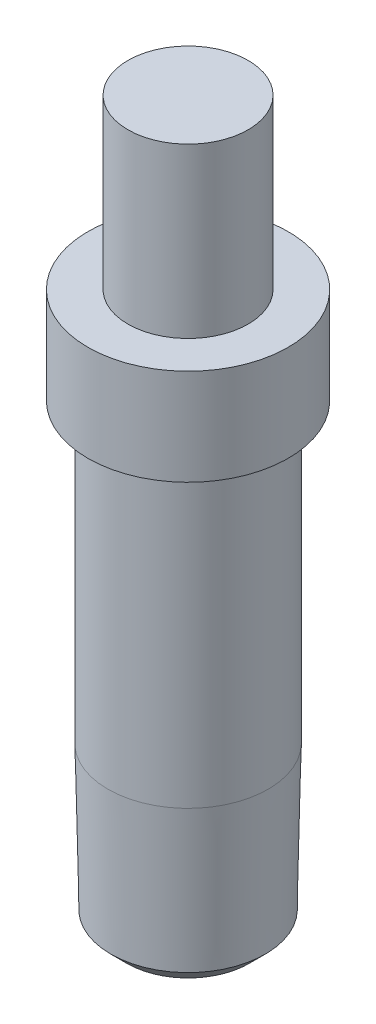
ISO-10303-21;
HEADER;
FILE_DESCRIPTION(('STEP AP214'),'2;1');
FILE_NAME('part.step','',(''),(''),'','','');
FILE_SCHEMA(('AUTOMOTIVE_DESIGN { 1 0 10303 214 1 1 1 1 }'));
ENDSEC;
DATA;
#1=APPLICATION_CONTEXT('core data for automotive mechanical design processes');
#2=APPLICATION_PROTOCOL_DEFINITION('international standard','automotive_design',2000,#1);
#3=PRODUCT_CONTEXT('',#1,'mechanical');
#4=PRODUCT('Part','Part','',(#3));
#5=PRODUCT_RELATED_PRODUCT_CATEGORY('part','',(#4));
#6=PRODUCT_DEFINITION_FORMATION('','',#4);
#7=PRODUCT_DEFINITION_CONTEXT('part definition',#1,'design');
#8=PRODUCT_DEFINITION('design','',#6,#7);
#9=PRODUCT_DEFINITION_SHAPE('','',#8);
#10=(LENGTH_UNIT() NAMED_UNIT(*) SI_UNIT(.MILLI.,.METRE.));
#11=(NAMED_UNIT(*) PLANE_ANGLE_UNIT() SI_UNIT($,.RADIAN.));
#12=(NAMED_UNIT(*) SI_UNIT($,.STERADIAN.) SOLID_ANGLE_UNIT());
#13=UNCERTAINTY_MEASURE_WITH_UNIT(LENGTH_MEASURE(1.E-05),#10,'distance_accuracy_value','');
#14=(GEOMETRIC_REPRESENTATION_CONTEXT(3) GLOBAL_UNCERTAINTY_ASSIGNED_CONTEXT((#13)) GLOBAL_UNIT_ASSIGNED_CONTEXT((#10,
#11,#12)) REPRESENTATION_CONTEXT('',''));
#15=CARTESIAN_POINT('',(0.,0.,0.));
#16=DIRECTION('',(0.,0.,1.));
#17=DIRECTION('',(1.,0.,0.));
#18=AXIS2_PLACEMENT_3D('',#15,#16,#17);
#19=CARTESIAN_POINT('',(0.,0.,0.));
#20=DIRECTION('',(0.,1.,0.));
#21=DIRECTION('',(0.,0.,1.));
#22=AXIS2_PLACEMENT_3D('',#19,#20,#21);
#23=PLANE('',#22);
#24=CARTESIAN_POINT('',(0.,0.,0.));
#25=DIRECTION('',(0.,1.,0.));
#26=DIRECTION('',(0.,0.,1.));
#27=AXIS2_PLACEMENT_3D('',#24,#25,#26);
#28=CIRCLE('',#27,0.763866832192437);
#29=CARTESIAN_POINT('',(0.,0.,0.763866832192437));
#30=VERTEX_POINT('',#29);
#31=EDGE_CURVE('E73',#30,#30,#28,.T.);
#32=ORIENTED_EDGE('',*,*,#31,.F.);
#33=EDGE_LOOP('',(#32));
#34=FACE_BOUND('',#33,.T.);
#35=ADVANCED_FACE('F44',(#34),#23,.F.);
#36=CARTESIAN_POINT('',(0.,2.,0.));
#37=DIRECTION('',(0.,1.,0.));
#38=DIRECTION('',(0.,0.,1.));
#39=AXIS2_PLACEMENT_3D('',#36,#37,#38);
#40=CONICAL_SURFACE('',#39,1.,0.0200712863979347);
#41=CARTESIAN_POINT('',(0.,0.200000000000001,0.));
#42=DIRECTION('',(0.,1.,0.));
#43=DIRECTION('',(0.,0.,1.));
#44=AXIS2_PLACEMENT_3D('',#41,#42,#43);
#45=CIRCLE('',#44,0.963866832192439);
#46=CARTESIAN_POINT('',(0.,0.200000000000001,0.963866832192439));
#47=VERTEX_POINT('',#46);
#48=EDGE_CURVE('E70',#47,#47,#45,.T.);
#49=ORIENTED_EDGE('',*,*,#48,.T.);
#50=EDGE_LOOP('',(#49));
#51=FACE_BOUND('',#50,.T.);
#52=CARTESIAN_POINT('',(0.,2.,0.));
#53=DIRECTION('',(0.,1.,0.));
#54=DIRECTION('',(0.,0.,1.));
#55=AXIS2_PLACEMENT_3D('',#52,#53,#54);
#56=CIRCLE('',#55,1.);
#57=CARTESIAN_POINT('',(0.,2.,1.));
#58=VERTEX_POINT('',#57);
#59=EDGE_CURVE('E67',#58,#58,#56,.T.);
#60=ORIENTED_EDGE('',*,*,#59,.F.);
#61=EDGE_LOOP('',(#60));
#62=FACE_BOUND('',#61,.T.);
#63=ADVANCED_FACE('F81',(#51,#62),#40,.T.);
#64=CARTESIAN_POINT('',(0.,0.200000000000001,0.));
#65=DIRECTION('',(0.,1.,0.));
#66=DIRECTION('',(0.,0.,1.));
#67=AXIS2_PLACEMENT_3D('',#64,#65,#66);
#68=CONICAL_SURFACE('',#67,0.963866832192439,0.785398163397453);
#69=ORIENTED_EDGE('',*,*,#31,.T.);
#70=EDGE_LOOP('',(#69));
#71=FACE_BOUND('',#70,.T.);
#72=ORIENTED_EDGE('',*,*,#48,.F.);
#73=EDGE_LOOP('',(#72));
#74=FACE_BOUND('',#73,.T.);
#75=ADVANCED_FACE('F77',(#71,#74),#68,.T.);
#76=CARTESIAN_POINT('',(0.,9.,0.));
#77=DIRECTION('',(0.,1.,0.));
#78=DIRECTION('',(0.,0.,1.));
#79=AXIS2_PLACEMENT_3D('',#76,#77,#78);
#80=CYLINDRICAL_SURFACE('',#79,1.);
#81=ORIENTED_EDGE('',*,*,#59,.T.);
#82=EDGE_LOOP('',(#81));
#83=FACE_BOUND('',#82,.T.);
#84=CARTESIAN_POINT('',(0.,5.7,0.));
#85=DIRECTION('',(0.,1.,0.));
#86=DIRECTION('',(0.,0.,1.));
#87=AXIS2_PLACEMENT_3D('',#84,#85,#86);
#88=CIRCLE('',#87,1.);
#89=CARTESIAN_POINT('',(0.,5.7,1.));
#90=VERTEX_POINT('',#89);
#91=EDGE_CURVE('E64',#90,#90,#88,.T.);
#92=ORIENTED_EDGE('',*,*,#91,.F.);
#93=EDGE_LOOP('',(#92));
#94=FACE_BOUND('',#93,.T.);
#95=ADVANCED_FACE('F101',(#83,#94),#80,.T.);
#96=CARTESIAN_POINT('',(1.25,5.7,0.));
#97=DIRECTION('',(0.,-1.,0.));
#98=DIRECTION('',(0.,0.,-1.));
#99=AXIS2_PLACEMENT_3D('',#96,#97,#98);
#100=PLANE('',#99);
#101=ORIENTED_EDGE('',*,*,#91,.T.);
#102=EDGE_LOOP('',(#101));
#103=FACE_BOUND('',#102,.T.);
#104=CARTESIAN_POINT('',(0.,5.7,0.));
#105=DIRECTION('',(0.,1.,0.));
#106=DIRECTION('',(0.,0.,1.));
#107=AXIS2_PLACEMENT_3D('',#104,#105,#106);
#108=CIRCLE('',#107,1.25);
#109=CARTESIAN_POINT('',(0.,5.7,1.25));
#110=VERTEX_POINT('',#109);
#111=EDGE_CURVE('E59',#110,#110,#108,.T.);
#112=ORIENTED_EDGE('',*,*,#111,.F.);
#113=EDGE_LOOP('',(#112));
#114=FACE_BOUND('',#113,.T.);
#115=ADVANCED_FACE('F98',(#103,#114),#100,.T.);
#116=CARTESIAN_POINT('',(0.,9.,0.));
#117=DIRECTION('',(0.,-1.,0.));
#118=DIRECTION('',(0.,0.,-1.));
#119=AXIS2_PLACEMENT_3D('',#116,#117,#118);
#120=CYLINDRICAL_SURFACE('',#119,1.25);
#121=ORIENTED_EDGE('',*,*,#111,.T.);
#122=EDGE_LOOP('',(#121));
#123=FACE_BOUND('',#122,.T.);
#124=CARTESIAN_POINT('',(0.,6.9,0.));
#125=DIRECTION('',(0.,1.,0.));
#126=DIRECTION('',(0.,0.,1.));
#127=AXIS2_PLACEMENT_3D('',#124,#125,#126);
#128=CIRCLE('',#127,1.25);
#129=CARTESIAN_POINT('',(0.,6.9,1.25));
#130=VERTEX_POINT('',#129);
#131=EDGE_CURVE('E55',#130,#130,#128,.T.);
#132=ORIENTED_EDGE('',*,*,#131,.F.);
#133=EDGE_LOOP('',(#132));
#134=FACE_BOUND('',#133,.T.);
#135=ADVANCED_FACE('F46',(#123,#134),#120,.T.);
#136=CARTESIAN_POINT('',(0.,9.,0.));
#137=DIRECTION('',(0.,1.,0.));
#138=DIRECTION('',(0.,0.,1.));
#139=AXIS2_PLACEMENT_3D('',#136,#137,#138);
#140=CYLINDRICAL_SURFACE('',#139,0.75);
#141=CARTESIAN_POINT('',(0.,6.9,0.));
#142=DIRECTION('',(0.,1.,0.));
#143=DIRECTION('',(0.,0.,1.));
#144=AXIS2_PLACEMENT_3D('',#141,#142,#143);
#145=CIRCLE('',#144,0.75);
#146=CARTESIAN_POINT('',(0.,6.9,0.75));
#147=VERTEX_POINT('',#146);
#148=EDGE_CURVE('E51',#147,#147,#145,.T.);
#149=ORIENTED_EDGE('',*,*,#148,.T.);
#150=EDGE_LOOP('',(#149));
#151=FACE_BOUND('',#150,.T.);
#152=CARTESIAN_POINT('',(0.,9.,0.));
#153=DIRECTION('',(0.,1.,0.));
#154=DIRECTION('',(0.,0.,1.));
#155=AXIS2_PLACEMENT_3D('',#152,#153,#154);
#156=CIRCLE('',#155,0.75);
#157=CARTESIAN_POINT('',(0.,9.,0.75));
#158=VERTEX_POINT('',#157);
#159=EDGE_CURVE('E12',#158,#158,#156,.T.);
#160=ORIENTED_EDGE('',*,*,#159,.F.);
#161=EDGE_LOOP('',(#160));
#162=FACE_BOUND('',#161,.T.);
#163=ADVANCED_FACE('F92',(#151,#162),#140,.T.);
#164=CARTESIAN_POINT('',(0.75,6.9,0.));
#165=DIRECTION('',(0.,1.,0.));
#166=DIRECTION('',(0.,0.,1.));
#167=AXIS2_PLACEMENT_3D('',#164,#165,#166);
#168=PLANE('',#167);
#169=ORIENTED_EDGE('',*,*,#131,.T.);
#170=EDGE_LOOP('',(#169));
#171=FACE_BOUND('',#170,.T.);
#172=ORIENTED_EDGE('',*,*,#148,.F.);
#173=EDGE_LOOP('',(#172));
#174=FACE_BOUND('',#173,.T.);
#175=ADVANCED_FACE('F91',(#171,#174),#168,.T.);
#176=CARTESIAN_POINT('',(0.,9.,0.));
#177=DIRECTION('',(0.,1.,0.));
#178=DIRECTION('',(0.,0.,1.));
#179=AXIS2_PLACEMENT_3D('',#176,#177,#178);
#180=PLANE('',#179);
#181=ORIENTED_EDGE('',*,*,#159,.T.);
#182=EDGE_LOOP('',(#181));
#183=FACE_BOUND('',#182,.T.);
#184=ADVANCED_FACE('F88',(#183),#180,.T.);
#185=CLOSED_SHELL('',(#35,#63,#75,#95,#115,#135,#163,#175,#184));
#186=MANIFOLD_SOLID_BREP('B2',#185);
#187=ADVANCED_BREP_SHAPE_REPRESENTATION('',(#18,#186),#14);
#188=SHAPE_DEFINITION_REPRESENTATION(#9,#187);
ENDSEC;
END-ISO-10303-21;
